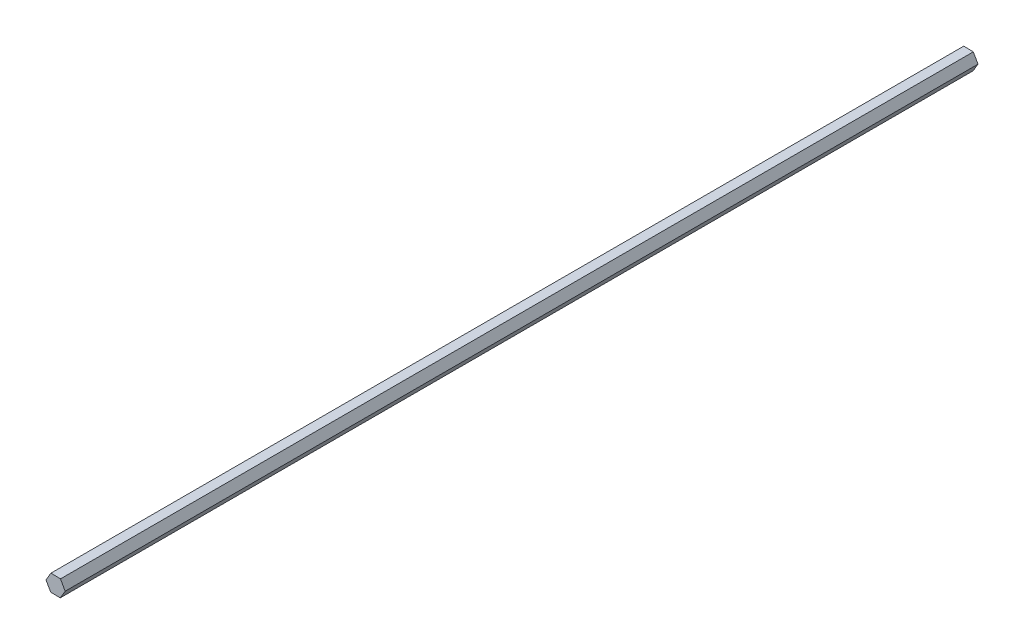
ISO-10303-21;
HEADER;
FILE_DESCRIPTION(('STEP AP214'),'2;1');
FILE_NAME('part.step','',(''),(''),'','','');
FILE_SCHEMA(('AUTOMOTIVE_DESIGN { 1 0 10303 214 1 1 1 1 }'));
ENDSEC;
DATA;
#1=APPLICATION_CONTEXT('core data for automotive mechanical design processes');
#2=APPLICATION_PROTOCOL_DEFINITION('international standard','automotive_design',2000,#1);
#3=PRODUCT_CONTEXT('',#1,'mechanical');
#4=PRODUCT('Part','Part','',(#3));
#5=PRODUCT_RELATED_PRODUCT_CATEGORY('part','',(#4));
#6=PRODUCT_DEFINITION_FORMATION('','',#4);
#7=PRODUCT_DEFINITION_CONTEXT('part definition',#1,'design');
#8=PRODUCT_DEFINITION('design','',#6,#7);
#9=PRODUCT_DEFINITION_SHAPE('','',#8);
#10=(LENGTH_UNIT() NAMED_UNIT(*) SI_UNIT(.MILLI.,.METRE.));
#11=(NAMED_UNIT(*) PLANE_ANGLE_UNIT() SI_UNIT($,.RADIAN.));
#12=(NAMED_UNIT(*) SI_UNIT($,.STERADIAN.) SOLID_ANGLE_UNIT());
#13=UNCERTAINTY_MEASURE_WITH_UNIT(LENGTH_MEASURE(1.E-05),#10,'distance_accuracy_value','');
#14=(GEOMETRIC_REPRESENTATION_CONTEXT(3) GLOBAL_UNCERTAINTY_ASSIGNED_CONTEXT((#13)) GLOBAL_UNIT_ASSIGNED_CONTEXT((#10,
#11,#12)) REPRESENTATION_CONTEXT('',''));
#15=CARTESIAN_POINT('',(0.,0.,0.));
#16=DIRECTION('',(0.,0.,1.));
#17=DIRECTION('',(1.,0.,0.));
#18=AXIS2_PLACEMENT_3D('',#15,#16,#17);
#19=CARTESIAN_POINT('',(-3.7583524336222,-6.29588121854435,698.5));
#20=DIRECTION('',(0.0145776044066588,0.999893741079402,0.));
#21=DIRECTION('',(-0.999893741079402,0.0145776044066588,0.));
#22=AXIS2_PLACEMENT_3D('',#19,#20,#21);
#23=PLANE('',#22);
#24=DIRECTION('',(0.999893741079402,-0.0145776044066588,0.));
#25=VECTOR('',#24,1.);
#26=CARTESIAN_POINT('',(-3.7583524336222,-6.29588121854435,0.));
#27=LINE('',#26,#25);
#28=CARTESIAN_POINT('',(-3.7583524336222,-6.29588121854435,0.));
#29=VERTEX_POINT('',#28);
#30=CARTESIAN_POINT('',(3.57321685765763,-6.40276929316407,0.));
#31=VERTEX_POINT('',#30);
#32=EDGE_CURVE('E123',#29,#31,#27,.T.);
#33=ORIENTED_EDGE('',*,*,#32,.T.);
#34=DIRECTION('',(0.,0.,-1.));
#35=VECTOR('',#34,1.);
#36=CARTESIAN_POINT('',(3.57321685765763,-6.40276929316407,698.5));
#37=LINE('',#36,#35);
#38=CARTESIAN_POINT('',(3.57321685765763,-6.40276929316407,698.5));
#39=VERTEX_POINT('',#38);
#40=EDGE_CURVE('E11',#39,#31,#37,.T.);
#41=ORIENTED_EDGE('',*,*,#40,.F.);
#42=DIRECTION('',(0.999893741079402,-0.0145776044066588,0.));
#43=VECTOR('',#42,1.);
#44=CARTESIAN_POINT('',(-3.7583524336222,-6.29588121854435,698.5));
#45=LINE('',#44,#43);
#46=CARTESIAN_POINT('',(-3.7583524336222,-6.29588121854435,698.5));
#47=VERTEX_POINT('',#46);
#48=EDGE_CURVE('E133',#47,#39,#45,.T.);
#49=ORIENTED_EDGE('',*,*,#48,.F.);
#50=DIRECTION('',(0.,0.,-1.));
#51=VECTOR('',#50,1.);
#52=CARTESIAN_POINT('',(-3.7583524336222,-6.29588121854435,698.5));
#53=LINE('',#52,#51);
#54=EDGE_CURVE('E119',#47,#29,#53,.T.);
#55=ORIENTED_EDGE('',*,*,#54,.T.);
#56=EDGE_LOOP('',(#33,#41,#49,#55));
#57=FACE_BOUND('',#56,.T.);
#58=ADVANCED_FACE('F39',(#57),#23,.F.);
#59=CARTESIAN_POINT('',(3.57321685765763,-6.40276929316407,698.5));
#60=DIRECTION('',(-0.858644578656493,0.512571446282188,0.));
#61=DIRECTION('',(-0.512571446282188,-0.858644578656493,0.));
#62=AXIS2_PLACEMENT_3D('',#59,#60,#61);
#63=PLANE('',#62);
#64=DIRECTION('',(0.512571446282188,0.858644578656493,0.));
#65=VECTOR('',#64,1.);
#66=CARTESIAN_POINT('',(3.57321685765763,-6.40276929316407,0.));
#67=LINE('',#66,#65);
#68=CARTESIAN_POINT('',(7.33156929127983,-0.10688807461972,0.));
#69=VERTEX_POINT('',#68);
#70=EDGE_CURVE('E126',#31,#69,#67,.T.);
#71=ORIENTED_EDGE('',*,*,#70,.T.);
#72=DIRECTION('',(0.,0.,-1.));
#73=VECTOR('',#72,1.);
#74=CARTESIAN_POINT('',(7.33156929127983,-0.10688807461972,698.5));
#75=LINE('',#74,#73);
#76=CARTESIAN_POINT('',(7.33156929127983,-0.10688807461972,698.5));
#77=VERTEX_POINT('',#76);
#78=EDGE_CURVE('E47',#77,#69,#75,.T.);
#79=ORIENTED_EDGE('',*,*,#78,.F.);
#80=DIRECTION('',(0.512571446282188,0.858644578656493,0.));
#81=VECTOR('',#80,1.);
#82=CARTESIAN_POINT('',(3.57321685765763,-6.40276929316407,698.5));
#83=LINE('',#82,#81);
#84=EDGE_CURVE('E92',#39,#77,#83,.T.);
#85=ORIENTED_EDGE('',*,*,#84,.F.);
#86=ORIENTED_EDGE('',*,*,#40,.T.);
#87=EDGE_LOOP('',(#71,#79,#85,#86));
#88=FACE_BOUND('',#87,.T.);
#89=ADVANCED_FACE('F157',(#88),#63,.F.);
#90=CARTESIAN_POINT('',(7.33156929127983,-0.10688807461972,698.5));
#91=DIRECTION('',(-0.873222183063152,-0.487322294797215,0.));
#92=DIRECTION('',(0.487322294797215,-0.873222183063152,0.));
#93=AXIS2_PLACEMENT_3D('',#90,#91,#92);
#94=PLANE('',#93);
#95=DIRECTION('',(-0.487322294797215,0.873222183063152,0.));
#96=VECTOR('',#95,1.);
#97=CARTESIAN_POINT('',(7.33156929127983,-0.10688807461972,0.));
#98=LINE('',#97,#96);
#99=CARTESIAN_POINT('',(3.7583524336222,6.29588121854435,0.));
#100=VERTEX_POINT('',#99);
#101=EDGE_CURVE('E128',#69,#100,#98,.T.);
#102=ORIENTED_EDGE('',*,*,#101,.T.);
#103=DIRECTION('',(0.,0.,-1.));
#104=VECTOR('',#103,1.);
#105=CARTESIAN_POINT('',(3.7583524336222,6.29588121854435,698.5));
#106=LINE('',#105,#104);
#107=CARTESIAN_POINT('',(3.7583524336222,6.29588121854435,698.5));
#108=VERTEX_POINT('',#107);
#109=EDGE_CURVE('E114',#108,#100,#106,.T.);
#110=ORIENTED_EDGE('',*,*,#109,.F.);
#111=DIRECTION('',(-0.487322294797215,0.873222183063152,0.));
#112=VECTOR('',#111,1.);
#113=CARTESIAN_POINT('',(7.33156929127983,-0.10688807461972,698.5));
#114=LINE('',#113,#112);
#115=EDGE_CURVE('E105',#77,#108,#114,.T.);
#116=ORIENTED_EDGE('',*,*,#115,.F.);
#117=ORIENTED_EDGE('',*,*,#78,.T.);
#118=EDGE_LOOP('',(#102,#110,#116,#117));
#119=FACE_BOUND('',#118,.T.);
#120=ADVANCED_FACE('F139',(#119),#94,.F.);
#121=CARTESIAN_POINT('',(3.7583524336222,6.29588121854435,698.5));
#122=DIRECTION('',(-0.014577604406659,-0.999893741079402,0.));
#123=DIRECTION('',(0.999893741079402,-0.014577604406659,0.));
#124=AXIS2_PLACEMENT_3D('',#121,#122,#123);
#125=PLANE('',#124);
#126=DIRECTION('',(-0.999893741079402,0.014577604406659,0.));
#127=VECTOR('',#126,1.);
#128=CARTESIAN_POINT('',(3.7583524336222,6.29588121854435,0.));
#129=LINE('',#128,#127);
#130=CARTESIAN_POINT('',(-3.57321685765764,6.40276929316407,0.));
#131=VERTEX_POINT('',#130);
#132=EDGE_CURVE('E113',#100,#131,#129,.T.);
#133=ORIENTED_EDGE('',*,*,#132,.T.);
#134=DIRECTION('',(0.,0.,-1.));
#135=VECTOR('',#134,1.);
#136=CARTESIAN_POINT('',(-3.57321685765764,6.40276929316407,698.5));
#137=LINE('',#136,#135);
#138=CARTESIAN_POINT('',(-3.57321685765764,6.40276929316407,698.5));
#139=VERTEX_POINT('',#138);
#140=EDGE_CURVE('E110',#139,#131,#137,.T.);
#141=ORIENTED_EDGE('',*,*,#140,.F.);
#142=DIRECTION('',(-0.999893741079402,0.014577604406659,0.));
#143=VECTOR('',#142,1.);
#144=CARTESIAN_POINT('',(3.7583524336222,6.29588121854435,698.5));
#145=LINE('',#144,#143);
#146=EDGE_CURVE('E99',#108,#139,#145,.T.);
#147=ORIENTED_EDGE('',*,*,#146,.F.);
#148=ORIENTED_EDGE('',*,*,#109,.T.);
#149=EDGE_LOOP('',(#133,#141,#147,#148));
#150=FACE_BOUND('',#149,.T.);
#151=ADVANCED_FACE('F111',(#150),#125,.F.);
#152=CARTESIAN_POINT('',(-3.57321685765764,6.40276929316407,698.5));
#153=DIRECTION('',(0.858644578656493,-0.512571446282188,0.));
#154=DIRECTION('',(0.512571446282188,0.858644578656493,0.));
#155=AXIS2_PLACEMENT_3D('',#152,#153,#154);
#156=PLANE('',#155);
#157=DIRECTION('',(-0.512571446282188,-0.858644578656493,0.));
#158=VECTOR('',#157,1.);
#159=CARTESIAN_POINT('',(-3.57321685765764,6.40276929316407,0.));
#160=LINE('',#159,#158);
#161=CARTESIAN_POINT('',(-7.33156929127983,0.106888074619719,0.));
#162=VERTEX_POINT('',#161);
#163=EDGE_CURVE('E78',#131,#162,#160,.T.);
#164=ORIENTED_EDGE('',*,*,#163,.T.);
#165=DIRECTION('',(0.,0.,-1.));
#166=VECTOR('',#165,1.);
#167=CARTESIAN_POINT('',(-7.33156929127983,0.106888074619719,698.5));
#168=LINE('',#167,#166);
#169=CARTESIAN_POINT('',(-7.33156929127983,0.106888074619719,698.5));
#170=VERTEX_POINT('',#169);
#171=EDGE_CURVE('E115',#170,#162,#168,.T.);
#172=ORIENTED_EDGE('',*,*,#171,.F.);
#173=DIRECTION('',(-0.512571446282188,-0.858644578656493,0.));
#174=VECTOR('',#173,1.);
#175=CARTESIAN_POINT('',(-3.57321685765764,6.40276929316407,698.5));
#176=LINE('',#175,#174);
#177=EDGE_CURVE('E103',#139,#170,#176,.T.);
#178=ORIENTED_EDGE('',*,*,#177,.F.);
#179=ORIENTED_EDGE('',*,*,#140,.T.);
#180=EDGE_LOOP('',(#164,#172,#178,#179));
#181=FACE_BOUND('',#180,.T.);
#182=ADVANCED_FACE('F117',(#181),#156,.F.);
#183=CARTESIAN_POINT('',(-7.33156929127983,0.106888074619719,698.5));
#184=DIRECTION('',(0.873222183063152,0.487322294797215,0.));
#185=DIRECTION('',(-0.487322294797215,0.873222183063152,0.));
#186=AXIS2_PLACEMENT_3D('',#183,#184,#185);
#187=PLANE('',#186);
#188=DIRECTION('',(0.487322294797215,-0.873222183063152,0.));
#189=VECTOR('',#188,1.);
#190=CARTESIAN_POINT('',(-7.33156929127983,0.106888074619719,0.));
#191=LINE('',#190,#189);
#192=EDGE_CURVE('E84',#162,#29,#191,.T.);
#193=ORIENTED_EDGE('',*,*,#192,.T.);
#194=ORIENTED_EDGE('',*,*,#54,.F.);
#195=DIRECTION('',(0.487322294797215,-0.873222183063152,0.));
#196=VECTOR('',#195,1.);
#197=CARTESIAN_POINT('',(-7.33156929127983,0.106888074619719,698.5));
#198=LINE('',#197,#196);
#199=EDGE_CURVE('E55',#170,#47,#198,.T.);
#200=ORIENTED_EDGE('',*,*,#199,.F.);
#201=ORIENTED_EDGE('',*,*,#171,.T.);
#202=EDGE_LOOP('',(#193,#194,#200,#201));
#203=FACE_BOUND('',#202,.T.);
#204=ADVANCED_FACE('F146',(#203),#187,.F.);
#205=CARTESIAN_POINT('',(0.,0.,698.5));
#206=DIRECTION('',(0.,0.,1.));
#207=DIRECTION('',(1.,0.,0.));
#208=AXIS2_PLACEMENT_3D('',#205,#206,#207);
#209=PLANE('',#208);
#210=ORIENTED_EDGE('',*,*,#48,.T.);
#211=ORIENTED_EDGE('',*,*,#84,.T.);
#212=ORIENTED_EDGE('',*,*,#115,.T.);
#213=ORIENTED_EDGE('',*,*,#146,.T.);
#214=ORIENTED_EDGE('',*,*,#177,.T.);
#215=ORIENTED_EDGE('',*,*,#199,.T.);
#216=EDGE_LOOP('',(#210,#211,#212,#213,#214,#215));
#217=FACE_BOUND('',#216,.T.);
#218=ADVANCED_FACE('F101',(#217),#209,.T.);
#219=CARTESIAN_POINT('',(0.,0.,0.));
#220=DIRECTION('',(0.,0.,1.));
#221=DIRECTION('',(1.,0.,0.));
#222=AXIS2_PLACEMENT_3D('',#219,#220,#221);
#223=PLANE('',#222);
#224=ORIENTED_EDGE('',*,*,#32,.F.);
#225=ORIENTED_EDGE('',*,*,#192,.F.);
#226=ORIENTED_EDGE('',*,*,#163,.F.);
#227=ORIENTED_EDGE('',*,*,#132,.F.);
#228=ORIENTED_EDGE('',*,*,#101,.F.);
#229=ORIENTED_EDGE('',*,*,#70,.F.);
#230=EDGE_LOOP('',(#224,#225,#226,#227,#228,#229));
#231=FACE_BOUND('',#230,.T.);
#232=ADVANCED_FACE('F142',(#231),#223,.F.);
#233=CLOSED_SHELL('',(#58,#89,#120,#151,#182,#204,#218,#232));
#234=MANIFOLD_SOLID_BREP('B2',#233);
#235=ADVANCED_BREP_SHAPE_REPRESENTATION('',(#18,#234),#14);
#236=SHAPE_DEFINITION_REPRESENTATION(#9,#235);
ENDSEC;
END-ISO-10303-21;
